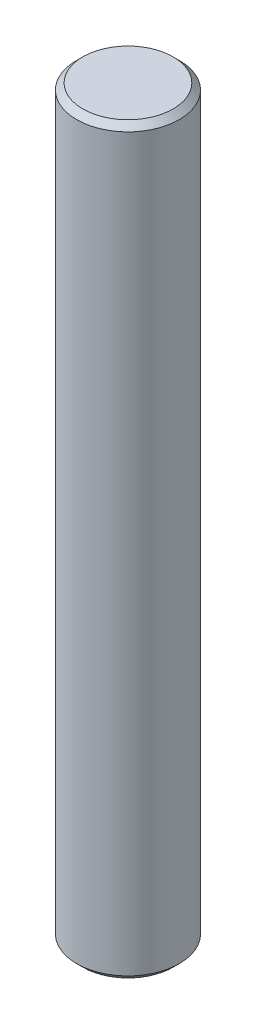
ISO-10303-21;
HEADER;
FILE_DESCRIPTION(('STEP AP214'),'2;1');
FILE_NAME('part.step','',(''),(''),'','','');
FILE_SCHEMA(('AUTOMOTIVE_DESIGN { 1 0 10303 214 1 1 1 1 }'));
ENDSEC;
DATA;
#1=APPLICATION_CONTEXT('core data for automotive mechanical design processes');
#2=APPLICATION_PROTOCOL_DEFINITION('international standard','automotive_design',2000,#1);
#3=PRODUCT_CONTEXT('',#1,'mechanical');
#4=PRODUCT('Part','Part','',(#3));
#5=PRODUCT_RELATED_PRODUCT_CATEGORY('part','',(#4));
#6=PRODUCT_DEFINITION_FORMATION('','',#4);
#7=PRODUCT_DEFINITION_CONTEXT('part definition',#1,'design');
#8=PRODUCT_DEFINITION('design','',#6,#7);
#9=PRODUCT_DEFINITION_SHAPE('','',#8);
#10=(LENGTH_UNIT() NAMED_UNIT(*) SI_UNIT(.MILLI.,.METRE.));
#11=(NAMED_UNIT(*) PLANE_ANGLE_UNIT() SI_UNIT($,.RADIAN.));
#12=(NAMED_UNIT(*) SI_UNIT($,.STERADIAN.) SOLID_ANGLE_UNIT());
#13=UNCERTAINTY_MEASURE_WITH_UNIT(LENGTH_MEASURE(1.E-05),#10,'distance_accuracy_value','');
#14=(GEOMETRIC_REPRESENTATION_CONTEXT(3) GLOBAL_UNCERTAINTY_ASSIGNED_CONTEXT((#13)) GLOBAL_UNIT_ASSIGNED_CONTEXT((#10,
#11,#12)) REPRESENTATION_CONTEXT('',''));
#15=CARTESIAN_POINT('',(0.,0.,0.));
#16=DIRECTION('',(0.,0.,1.));
#17=DIRECTION('',(1.,0.,0.));
#18=AXIS2_PLACEMENT_3D('',#15,#16,#17);
#19=CARTESIAN_POINT('',(0.,36.2,0.));
#20=DIRECTION('',(0.,-1.,0.));
#21=DIRECTION('',(0.,0.,-1.));
#22=AXIS2_PLACEMENT_3D('',#19,#20,#21);
#23=CYLINDRICAL_SURFACE('',#22,2.5);
#24=CARTESIAN_POINT('',(0.,0.300000000000016,0.));
#25=DIRECTION('',(0.,1.,0.));
#26=DIRECTION('',(0.,0.,1.));
#27=AXIS2_PLACEMENT_3D('',#24,#25,#26);
#28=CIRCLE('',#27,2.5);
#29=CARTESIAN_POINT('',(0.,0.300000000000016,2.5));
#30=VERTEX_POINT('',#29);
#31=EDGE_CURVE('E45',#30,#30,#28,.T.);
#32=ORIENTED_EDGE('',*,*,#31,.T.);
#33=EDGE_LOOP('',(#32));
#34=FACE_BOUND('',#33,.T.);
#35=CARTESIAN_POINT('',(0.,35.9,0.));
#36=DIRECTION('',(0.,1.,0.));
#37=DIRECTION('',(0.,0.,1.));
#38=AXIS2_PLACEMENT_3D('',#35,#36,#37);
#39=CIRCLE('',#38,2.5);
#40=CARTESIAN_POINT('',(0.,35.9,2.5));
#41=VERTEX_POINT('',#40);
#42=EDGE_CURVE('E49',#41,#41,#39,.F.);
#43=ORIENTED_EDGE('',*,*,#42,.T.);
#44=EDGE_LOOP('',(#43));
#45=FACE_BOUND('',#44,.T.);
#46=ADVANCED_FACE('F33',(#34,#45),#23,.T.);
#47=CARTESIAN_POINT('',(0.,36.2,0.));
#48=DIRECTION('',(0.,1.,0.));
#49=DIRECTION('',(0.,0.,1.));
#50=AXIS2_PLACEMENT_3D('',#47,#48,#49);
#51=PLANE('',#50);
#52=CARTESIAN_POINT('',(0.,36.2,0.));
#53=DIRECTION('',(0.,1.,0.));
#54=DIRECTION('',(0.,0.,1.));
#55=AXIS2_PLACEMENT_3D('',#52,#53,#54);
#56=CIRCLE('',#55,2.20000000000001);
#57=CARTESIAN_POINT('',(0.,36.2,2.20000000000001));
#58=VERTEX_POINT('',#57);
#59=EDGE_CURVE('E10',#58,#58,#56,.T.);
#60=ORIENTED_EDGE('',*,*,#59,.T.);
#61=EDGE_LOOP('',(#60));
#62=FACE_BOUND('',#61,.T.);
#63=ADVANCED_FACE('F65',(#62),#51,.T.);
#64=CARTESIAN_POINT('',(0.,0.,0.));
#65=DIRECTION('',(0.,1.,0.));
#66=DIRECTION('',(0.,0.,1.));
#67=AXIS2_PLACEMENT_3D('',#64,#65,#66);
#68=PLANE('',#67);
#69=CARTESIAN_POINT('',(0.,0.,0.));
#70=DIRECTION('',(0.,1.,0.));
#71=DIRECTION('',(0.,0.,1.));
#72=AXIS2_PLACEMENT_3D('',#69,#70,#71);
#73=CIRCLE('',#72,2.19999999999998);
#74=CARTESIAN_POINT('',(0.,0.,2.19999999999998));
#75=VERTEX_POINT('',#74);
#76=EDGE_CURVE('E41',#75,#75,#73,.F.);
#77=ORIENTED_EDGE('',*,*,#76,.T.);
#78=EDGE_LOOP('',(#77));
#79=FACE_BOUND('',#78,.T.);
#80=ADVANCED_FACE('F62',(#79),#68,.F.);
#81=CARTESIAN_POINT('',(0.,0.300000000000016,0.));
#82=DIRECTION('',(0.,1.,0.));
#83=DIRECTION('',(0.,0.,1.));
#84=AXIS2_PLACEMENT_3D('',#81,#82,#83);
#85=CONICAL_SURFACE('',#84,2.5,0.78539816339745);
#86=ORIENTED_EDGE('',*,*,#76,.F.);
#87=EDGE_LOOP('',(#86));
#88=FACE_BOUND('',#87,.T.);
#89=ORIENTED_EDGE('',*,*,#31,.F.);
#90=EDGE_LOOP('',(#89));
#91=FACE_BOUND('',#90,.T.);
#92=ADVANCED_FACE('F58',(#88,#91),#85,.T.);
#93=CARTESIAN_POINT('',(0.,36.2,0.));
#94=DIRECTION('',(0.,-1.,0.));
#95=DIRECTION('',(0.,0.,-1.));
#96=AXIS2_PLACEMENT_3D('',#93,#94,#95);
#97=CONICAL_SURFACE('',#96,2.20000000000001,0.78539816339745);
#98=ORIENTED_EDGE('',*,*,#42,.F.);
#99=EDGE_LOOP('',(#98));
#100=FACE_BOUND('',#99,.T.);
#101=ORIENTED_EDGE('',*,*,#59,.F.);
#102=EDGE_LOOP('',(#101));
#103=FACE_BOUND('',#102,.T.);
#104=ADVANCED_FACE('F36',(#100,#103),#97,.T.);
#105=CLOSED_SHELL('',(#46,#63,#80,#92,#104));
#106=MANIFOLD_SOLID_BREP('B2',#105);
#107=ADVANCED_BREP_SHAPE_REPRESENTATION('',(#18,#106),#14);
#108=SHAPE_DEFINITION_REPRESENTATION(#9,#107);
ENDSEC;
END-ISO-10303-21;
